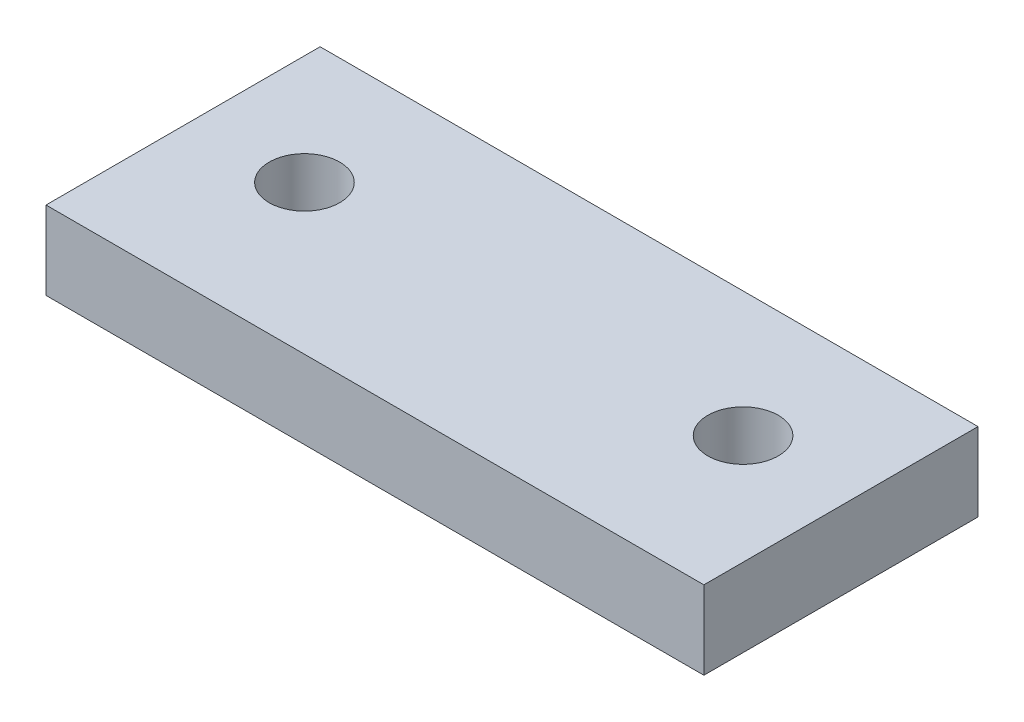
ISO-10303-21;
HEADER;
FILE_DESCRIPTION(('STEP AP214'),'2;1');
FILE_NAME('part.step','',(''),(''),'','','');
FILE_SCHEMA(('AUTOMOTIVE_DESIGN { 1 0 10303 214 1 1 1 1 }'));
ENDSEC;
DATA;
#1=APPLICATION_CONTEXT('core data for automotive mechanical design processes');
#2=APPLICATION_PROTOCOL_DEFINITION('international standard','automotive_design',2000,#1);
#3=PRODUCT_CONTEXT('',#1,'mechanical');
#4=PRODUCT('Part','Part','',(#3));
#5=PRODUCT_RELATED_PRODUCT_CATEGORY('part','',(#4));
#6=PRODUCT_DEFINITION_FORMATION('','',#4);
#7=PRODUCT_DEFINITION_CONTEXT('part definition',#1,'design');
#8=PRODUCT_DEFINITION('design','',#6,#7);
#9=PRODUCT_DEFINITION_SHAPE('','',#8);
#10=(LENGTH_UNIT() NAMED_UNIT(*) SI_UNIT(.MILLI.,.METRE.));
#11=(NAMED_UNIT(*) PLANE_ANGLE_UNIT() SI_UNIT($,.RADIAN.));
#12=(NAMED_UNIT(*) SI_UNIT($,.STERADIAN.) SOLID_ANGLE_UNIT());
#13=UNCERTAINTY_MEASURE_WITH_UNIT(LENGTH_MEASURE(1.E-05),#10,'distance_accuracy_value','');
#14=(GEOMETRIC_REPRESENTATION_CONTEXT(3) GLOBAL_UNCERTAINTY_ASSIGNED_CONTEXT((#13)) GLOBAL_UNIT_ASSIGNED_CONTEXT((#10,
#11,#12)) REPRESENTATION_CONTEXT('',''));
#15=CARTESIAN_POINT('',(0.,0.,0.));
#16=DIRECTION('',(0.,0.,1.));
#17=DIRECTION('',(1.,0.,0.));
#18=AXIS2_PLACEMENT_3D('',#15,#16,#17);
#19=CARTESIAN_POINT('',(0.,5.,0.));
#20=DIRECTION('',(1.,0.,0.));
#21=DIRECTION('',(0.,0.,-1.));
#22=AXIS2_PLACEMENT_3D('',#19,#20,#21);
#23=PLANE('',#22);
#24=DIRECTION('',(0.,0.,1.));
#25=VECTOR('',#24,1.);
#26=CARTESIAN_POINT('',(0.,0.,0.));
#27=LINE('',#26,#25);
#28=CARTESIAN_POINT('',(0.,0.,-17.5));
#29=VERTEX_POINT('',#28);
#30=CARTESIAN_POINT('',(0.,0.,0.));
#31=VERTEX_POINT('',#30);
#32=EDGE_CURVE('E96',#29,#31,#27,.T.);
#33=ORIENTED_EDGE('',*,*,#32,.T.);
#34=DIRECTION('',(0.,-1.,0.));
#35=VECTOR('',#34,1.);
#36=CARTESIAN_POINT('',(0.,5.,0.));
#37=LINE('',#36,#35);
#38=CARTESIAN_POINT('',(0.,5.,0.));
#39=VERTEX_POINT('',#38);
#40=EDGE_CURVE('E11',#39,#31,#37,.T.);
#41=ORIENTED_EDGE('',*,*,#40,.F.);
#42=DIRECTION('',(0.,0.,1.));
#43=VECTOR('',#42,1.);
#44=CARTESIAN_POINT('',(0.,5.,0.));
#45=LINE('',#44,#43);
#46=CARTESIAN_POINT('',(0.,5.,-17.5));
#47=VERTEX_POINT('',#46);
#48=EDGE_CURVE('E84',#47,#39,#45,.T.);
#49=ORIENTED_EDGE('',*,*,#48,.F.);
#50=DIRECTION('',(0.,-1.,0.));
#51=VECTOR('',#50,1.);
#52=CARTESIAN_POINT('',(0.,5.,-17.5));
#53=LINE('',#52,#51);
#54=EDGE_CURVE('E92',#47,#29,#53,.T.);
#55=ORIENTED_EDGE('',*,*,#54,.T.);
#56=EDGE_LOOP('',(#33,#41,#49,#55));
#57=FACE_BOUND('',#56,.T.);
#58=ADVANCED_FACE('F33',(#57),#23,.F.);
#59=CARTESIAN_POINT('',(0.,5.,0.));
#60=DIRECTION('',(0.,0.,-1.));
#61=DIRECTION('',(-1.,0.,0.));
#62=AXIS2_PLACEMENT_3D('',#59,#60,#61);
#63=PLANE('',#62);
#64=DIRECTION('',(1.,0.,0.));
#65=VECTOR('',#64,1.);
#66=CARTESIAN_POINT('',(0.,0.,0.));
#67=LINE('',#66,#65);
#68=CARTESIAN_POINT('',(42.,0.,0.));
#69=VERTEX_POINT('',#68);
#70=EDGE_CURVE('E88',#31,#69,#67,.T.);
#71=ORIENTED_EDGE('',*,*,#70,.T.);
#72=DIRECTION('',(0.,-1.,0.));
#73=VECTOR('',#72,1.);
#74=CARTESIAN_POINT('',(42.,5.,0.));
#75=LINE('',#74,#73);
#76=CARTESIAN_POINT('',(42.,5.,0.));
#77=VERTEX_POINT('',#76);
#78=EDGE_CURVE('E41',#77,#69,#75,.T.);
#79=ORIENTED_EDGE('',*,*,#78,.F.);
#80=DIRECTION('',(1.,0.,0.));
#81=VECTOR('',#80,1.);
#82=CARTESIAN_POINT('',(0.,5.,0.));
#83=LINE('',#82,#81);
#84=EDGE_CURVE('E79',#39,#77,#83,.T.);
#85=ORIENTED_EDGE('',*,*,#84,.F.);
#86=ORIENTED_EDGE('',*,*,#40,.T.);
#87=EDGE_LOOP('',(#71,#79,#85,#86));
#88=FACE_BOUND('',#87,.T.);
#89=ADVANCED_FACE('F87',(#88),#63,.F.);
#90=CARTESIAN_POINT('',(42.,5.,0.));
#91=DIRECTION('',(-1.,0.,0.));
#92=DIRECTION('',(0.,0.,1.));
#93=AXIS2_PLACEMENT_3D('',#90,#91,#92);
#94=PLANE('',#93);
#95=DIRECTION('',(0.,0.,-1.));
#96=VECTOR('',#95,1.);
#97=CARTESIAN_POINT('',(42.,0.,0.));
#98=LINE('',#97,#96);
#99=CARTESIAN_POINT('',(42.,0.,-17.5));
#100=VERTEX_POINT('',#99);
#101=EDGE_CURVE('E66',#69,#100,#98,.T.);
#102=ORIENTED_EDGE('',*,*,#101,.T.);
#103=DIRECTION('',(0.,-1.,0.));
#104=VECTOR('',#103,1.);
#105=CARTESIAN_POINT('',(42.,5.,-17.5));
#106=LINE('',#105,#104);
#107=CARTESIAN_POINT('',(42.,5.,-17.5));
#108=VERTEX_POINT('',#107);
#109=EDGE_CURVE('E89',#108,#100,#106,.T.);
#110=ORIENTED_EDGE('',*,*,#109,.F.);
#111=DIRECTION('',(0.,0.,-1.));
#112=VECTOR('',#111,1.);
#113=CARTESIAN_POINT('',(42.,5.,0.));
#114=LINE('',#113,#112);
#115=EDGE_CURVE('E82',#77,#108,#114,.T.);
#116=ORIENTED_EDGE('',*,*,#115,.F.);
#117=ORIENTED_EDGE('',*,*,#78,.T.);
#118=EDGE_LOOP('',(#102,#110,#116,#117));
#119=FACE_BOUND('',#118,.T.);
#120=ADVANCED_FACE('F90',(#119),#94,.F.);
#121=CARTESIAN_POINT('',(0.,5.,-17.5));
#122=DIRECTION('',(0.,0.,1.));
#123=DIRECTION('',(1.,0.,0.));
#124=AXIS2_PLACEMENT_3D('',#121,#122,#123);
#125=PLANE('',#124);
#126=DIRECTION('',(-1.,0.,0.));
#127=VECTOR('',#126,1.);
#128=CARTESIAN_POINT('',(0.,0.,-17.5));
#129=LINE('',#128,#127);
#130=EDGE_CURVE('E72',#100,#29,#129,.T.);
#131=ORIENTED_EDGE('',*,*,#130,.T.);
#132=ORIENTED_EDGE('',*,*,#54,.F.);
#133=DIRECTION('',(-1.,0.,0.));
#134=VECTOR('',#133,1.);
#135=CARTESIAN_POINT('',(0.,5.,-17.5));
#136=LINE('',#135,#134);
#137=EDGE_CURVE('E49',#108,#47,#136,.T.);
#138=ORIENTED_EDGE('',*,*,#137,.F.);
#139=ORIENTED_EDGE('',*,*,#109,.T.);
#140=EDGE_LOOP('',(#131,#132,#138,#139));
#141=FACE_BOUND('',#140,.T.);
#142=ADVANCED_FACE('F104',(#141),#125,.F.);
#143=CARTESIAN_POINT('',(0.,5.,-17.5));
#144=DIRECTION('',(0.,-1.,0.));
#145=DIRECTION('',(0.,0.,-1.));
#146=AXIS2_PLACEMENT_3D('',#143,#144,#145);
#147=PLANE('',#146);
#148=CARTESIAN_POINT('',(35.,5.,-9.5));
#149=DIRECTION('',(0.,1.,0.));
#150=DIRECTION('',(0.,0.,-1.));
#151=AXIS2_PLACEMENT_3D('',#148,#149,#150);
#152=CIRCLE('',#151,2.25);
#153=CARTESIAN_POINT('',(35.,5.,-11.75));
#154=VERTEX_POINT('',#153);
#155=EDGE_CURVE('E116',#154,#154,#152,.T.);
#156=ORIENTED_EDGE('',*,*,#155,.F.);
#157=EDGE_LOOP('',(#156));
#158=FACE_BOUND('',#157,.T.);
#159=CARTESIAN_POINT('',(7.,5.,-9.5));
#160=DIRECTION('',(0.,1.,0.));
#161=DIRECTION('',(0.,0.,1.));
#162=AXIS2_PLACEMENT_3D('',#159,#160,#161);
#163=CIRCLE('',#162,2.25);
#164=CARTESIAN_POINT('',(7.,5.,-7.25));
#165=VERTEX_POINT('',#164);
#166=EDGE_CURVE('E110',#165,#165,#163,.T.);
#167=ORIENTED_EDGE('',*,*,#166,.F.);
#168=EDGE_LOOP('',(#167));
#169=FACE_BOUND('',#168,.T.);
#170=ORIENTED_EDGE('',*,*,#48,.T.);
#171=ORIENTED_EDGE('',*,*,#84,.T.);
#172=ORIENTED_EDGE('',*,*,#115,.T.);
#173=ORIENTED_EDGE('',*,*,#137,.T.);
#174=EDGE_LOOP('',(#170,#171,#172,#173));
#175=FACE_BOUND('',#174,.T.);
#176=ADVANCED_FACE('F80',(#158,#169,#175),#147,.F.);
#177=CARTESIAN_POINT('',(0.,0.,-17.5));
#178=DIRECTION('',(0.,-1.,0.));
#179=DIRECTION('',(0.,0.,-1.));
#180=AXIS2_PLACEMENT_3D('',#177,#178,#179);
#181=PLANE('',#180);
#182=CARTESIAN_POINT('',(35.,0.,-9.5));
#183=DIRECTION('',(0.,1.,0.));
#184=DIRECTION('',(0.,0.,-1.));
#185=AXIS2_PLACEMENT_3D('',#182,#183,#184);
#186=CIRCLE('',#185,2.25);
#187=CARTESIAN_POINT('',(35.,0.,-11.75));
#188=VERTEX_POINT('',#187);
#189=EDGE_CURVE('E113',#188,#188,#186,.T.);
#190=ORIENTED_EDGE('',*,*,#189,.T.);
#191=EDGE_LOOP('',(#190));
#192=FACE_BOUND('',#191,.T.);
#193=CARTESIAN_POINT('',(7.,0.,-9.5));
#194=DIRECTION('',(0.,1.,0.));
#195=DIRECTION('',(0.,0.,1.));
#196=AXIS2_PLACEMENT_3D('',#193,#194,#195);
#197=CIRCLE('',#196,2.25);
#198=CARTESIAN_POINT('',(7.,0.,-7.25));
#199=VERTEX_POINT('',#198);
#200=EDGE_CURVE('E99',#199,#199,#197,.T.);
#201=ORIENTED_EDGE('',*,*,#200,.T.);
#202=EDGE_LOOP('',(#201));
#203=FACE_BOUND('',#202,.T.);
#204=ORIENTED_EDGE('',*,*,#32,.F.);
#205=ORIENTED_EDGE('',*,*,#130,.F.);
#206=ORIENTED_EDGE('',*,*,#101,.F.);
#207=ORIENTED_EDGE('',*,*,#70,.F.);
#208=EDGE_LOOP('',(#204,#205,#206,#207));
#209=FACE_BOUND('',#208,.T.);
#210=ADVANCED_FACE('F107',(#192,#203,#209),#181,.T.);
#211=CARTESIAN_POINT('',(7.,0.,-9.5));
#212=DIRECTION('',(0.,1.,0.));
#213=DIRECTION('',(0.,0.,1.));
#214=AXIS2_PLACEMENT_3D('',#211,#212,#213);
#215=CYLINDRICAL_SURFACE('',#214,2.25);
#216=ORIENTED_EDGE('',*,*,#200,.F.);
#217=EDGE_LOOP('',(#216));
#218=FACE_BOUND('',#217,.T.);
#219=ORIENTED_EDGE('',*,*,#166,.T.);
#220=EDGE_LOOP('',(#219));
#221=FACE_BOUND('',#220,.T.);
#222=ADVANCED_FACE('F127',(#218,#221),#215,.F.);
#223=CARTESIAN_POINT('',(35.,0.,-9.5));
#224=DIRECTION('',(0.,1.,0.));
#225=DIRECTION('',(0.,0.,1.));
#226=AXIS2_PLACEMENT_3D('',#223,#224,#225);
#227=CYLINDRICAL_SURFACE('',#226,2.25);
#228=ORIENTED_EDGE('',*,*,#189,.F.);
#229=EDGE_LOOP('',(#228));
#230=FACE_BOUND('',#229,.T.);
#231=ORIENTED_EDGE('',*,*,#155,.T.);
#232=EDGE_LOOP('',(#231));
#233=FACE_BOUND('',#232,.T.);
#234=ADVANCED_FACE('F124',(#230,#233),#227,.F.);
#235=CLOSED_SHELL('',(#58,#89,#120,#142,#176,#210,#222,#234));
#236=MANIFOLD_SOLID_BREP('B2',#235);
#237=ADVANCED_BREP_SHAPE_REPRESENTATION('',(#18,#236),#14);
#238=SHAPE_DEFINITION_REPRESENTATION(#9,#237);
ENDSEC;
END-ISO-10303-21;
